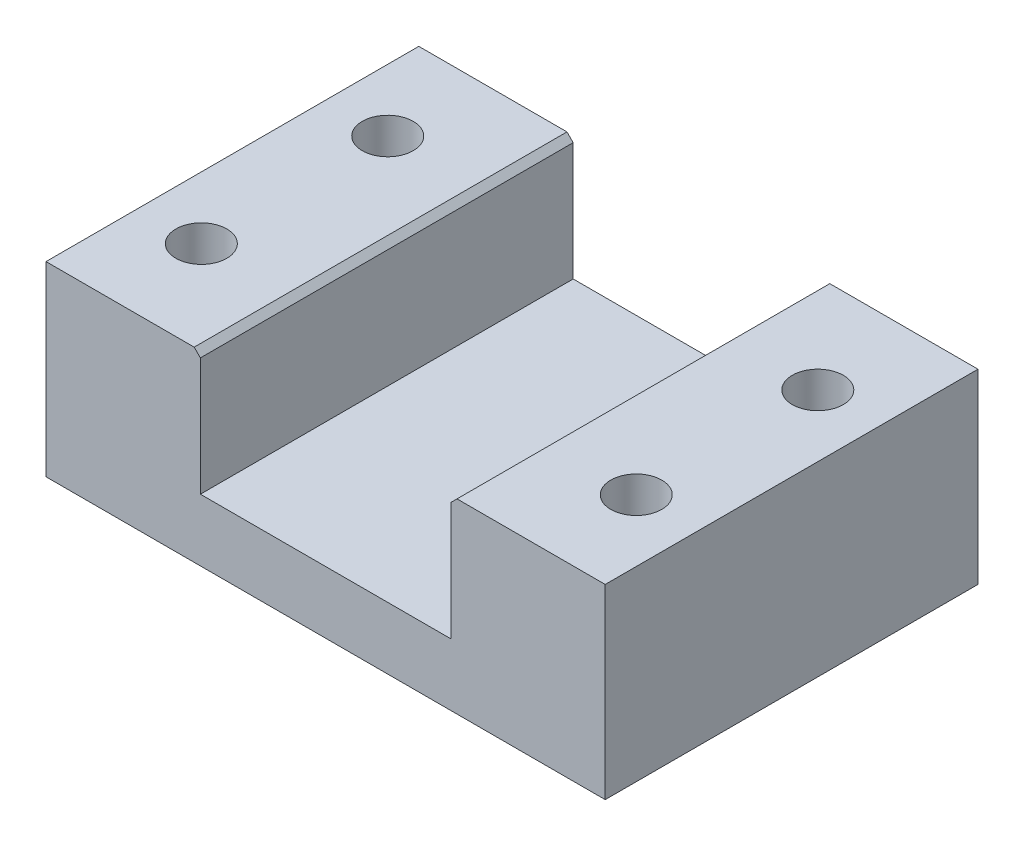
ISO-10303-21;
HEADER;
FILE_DESCRIPTION(('STEP AP214'),'2;1');
FILE_NAME('part.step','',(''),(''),'','','');
FILE_SCHEMA(('AUTOMOTIVE_DESIGN { 1 0 10303 214 1 1 1 1 }'));
ENDSEC;
DATA;
#1=APPLICATION_CONTEXT('core data for automotive mechanical design processes');
#2=APPLICATION_PROTOCOL_DEFINITION('international standard','automotive_design',2000,#1);
#3=PRODUCT_CONTEXT('',#1,'mechanical');
#4=PRODUCT('Part','Part','',(#3));
#5=PRODUCT_RELATED_PRODUCT_CATEGORY('part','',(#4));
#6=PRODUCT_DEFINITION_FORMATION('','',#4);
#7=PRODUCT_DEFINITION_CONTEXT('part definition',#1,'design');
#8=PRODUCT_DEFINITION('design','',#6,#7);
#9=PRODUCT_DEFINITION_SHAPE('','',#8);
#10=(LENGTH_UNIT() NAMED_UNIT(*) SI_UNIT(.MILLI.,.METRE.));
#11=(NAMED_UNIT(*) PLANE_ANGLE_UNIT() SI_UNIT($,.RADIAN.));
#12=(NAMED_UNIT(*) SI_UNIT($,.STERADIAN.) SOLID_ANGLE_UNIT());
#13=UNCERTAINTY_MEASURE_WITH_UNIT(LENGTH_MEASURE(1.E-05),#10,'distance_accuracy_value','');
#14=(GEOMETRIC_REPRESENTATION_CONTEXT(3) GLOBAL_UNCERTAINTY_ASSIGNED_CONTEXT((#13)) GLOBAL_UNIT_ASSIGNED_CONTEXT((#10,
#11,#12)) REPRESENTATION_CONTEXT('',''));
#15=CARTESIAN_POINT('',(0.,0.,0.));
#16=DIRECTION('',(0.,0.,1.));
#17=DIRECTION('',(1.,0.,0.));
#18=AXIS2_PLACEMENT_3D('',#15,#16,#17);
#19=CARTESIAN_POINT('',(-35.,30.,15.));
#20=DIRECTION('',(0.,-1.,0.));
#21=DIRECTION('',(0.,0.,-1.));
#22=AXIS2_PLACEMENT_3D('',#19,#20,#21);
#23=CYLINDRICAL_SURFACE('',#22,4.1);
#24=CARTESIAN_POINT('',(-35.,30.,15.));
#25=DIRECTION('',(0.,-1.,0.));
#26=DIRECTION('',(0.,0.,-1.));
#27=AXIS2_PLACEMENT_3D('',#24,#25,#26);
#28=CIRCLE('',#27,4.1);
#29=CARTESIAN_POINT('',(-35.,30.,10.9));
#30=VERTEX_POINT('',#29);
#31=EDGE_CURVE('E143',#30,#30,#28,.T.);
#32=ORIENTED_EDGE('',*,*,#31,.F.);
#33=EDGE_LOOP('',(#32));
#34=FACE_BOUND('',#33,.T.);
#35=CARTESIAN_POINT('',(-35.,10.,15.));
#36=DIRECTION('',(0.,-1.,0.));
#37=DIRECTION('',(0.,0.,-1.));
#38=AXIS2_PLACEMENT_3D('',#35,#36,#37);
#39=CIRCLE('',#38,4.1);
#40=CARTESIAN_POINT('',(-35.,10.,10.9));
#41=VERTEX_POINT('',#40);
#42=EDGE_CURVE('E194',#41,#41,#39,.F.);
#43=ORIENTED_EDGE('',*,*,#42,.F.);
#44=EDGE_LOOP('',(#43));
#45=FACE_BOUND('',#44,.T.);
#46=ADVANCED_FACE('F35',(#34,#45),#23,.F.);
#47=CARTESIAN_POINT('',(35.,30.,-14.2172732356869));
#48=DIRECTION('',(0.,-1.,0.));
#49=DIRECTION('',(0.,0.,-1.));
#50=AXIS2_PLACEMENT_3D('',#47,#48,#49);
#51=CYLINDRICAL_SURFACE('',#50,4.1);
#52=CARTESIAN_POINT('',(35.,30.,-14.2172732356869));
#53=DIRECTION('',(0.,-1.,0.));
#54=DIRECTION('',(0.,0.,-1.));
#55=AXIS2_PLACEMENT_3D('',#52,#53,#54);
#56=CIRCLE('',#55,4.1);
#57=CARTESIAN_POINT('',(35.,30.,-18.3172732356869));
#58=VERTEX_POINT('',#57);
#59=EDGE_CURVE('E328',#58,#58,#56,.T.);
#60=ORIENTED_EDGE('',*,*,#59,.F.);
#61=EDGE_LOOP('',(#60));
#62=FACE_BOUND('',#61,.T.);
#63=CARTESIAN_POINT('',(35.,10.,-14.2172732356869));
#64=DIRECTION('',(0.,-1.,0.));
#65=DIRECTION('',(0.,0.,-1.));
#66=AXIS2_PLACEMENT_3D('',#63,#64,#65);
#67=CIRCLE('',#66,4.1);
#68=CARTESIAN_POINT('',(35.,10.,-18.3172732356869));
#69=VERTEX_POINT('',#68);
#70=EDGE_CURVE('E190',#69,#69,#67,.F.);
#71=ORIENTED_EDGE('',*,*,#70,.F.);
#72=EDGE_LOOP('',(#71));
#73=FACE_BOUND('',#72,.T.);
#74=ADVANCED_FACE('F253',(#62,#73),#51,.F.);
#75=CARTESIAN_POINT('',(-35.,30.,-15.));
#76=DIRECTION('',(0.,-1.,0.));
#77=DIRECTION('',(0.,0.,-1.));
#78=AXIS2_PLACEMENT_3D('',#75,#76,#77);
#79=CYLINDRICAL_SURFACE('',#78,4.1);
#80=CARTESIAN_POINT('',(-35.,30.,-15.));
#81=DIRECTION('',(0.,-1.,0.));
#82=DIRECTION('',(0.,0.,-1.));
#83=AXIS2_PLACEMENT_3D('',#80,#81,#82);
#84=CIRCLE('',#83,4.1);
#85=CARTESIAN_POINT('',(-35.,30.,-19.1));
#86=VERTEX_POINT('',#85);
#87=EDGE_CURVE('E325',#86,#86,#84,.T.);
#88=ORIENTED_EDGE('',*,*,#87,.F.);
#89=EDGE_LOOP('',(#88));
#90=FACE_BOUND('',#89,.T.);
#91=CARTESIAN_POINT('',(-35.,10.,-15.));
#92=DIRECTION('',(0.,-1.,0.));
#93=DIRECTION('',(0.,0.,-1.));
#94=AXIS2_PLACEMENT_3D('',#91,#92,#93);
#95=CIRCLE('',#94,4.1);
#96=CARTESIAN_POINT('',(-35.,10.,-19.1));
#97=VERTEX_POINT('',#96);
#98=EDGE_CURVE('E187',#97,#97,#95,.F.);
#99=ORIENTED_EDGE('',*,*,#98,.F.);
#100=EDGE_LOOP('',(#99));
#101=FACE_BOUND('',#100,.T.);
#102=ADVANCED_FACE('F243',(#90,#101),#79,.F.);
#103=CARTESIAN_POINT('',(35.,30.,15.));
#104=DIRECTION('',(0.,-1.,0.));
#105=DIRECTION('',(0.,0.,-1.));
#106=AXIS2_PLACEMENT_3D('',#103,#104,#105);
#107=CYLINDRICAL_SURFACE('',#106,4.1);
#108=CARTESIAN_POINT('',(35.,30.,15.));
#109=DIRECTION('',(0.,-1.,0.));
#110=DIRECTION('',(0.,0.,-1.));
#111=AXIS2_PLACEMENT_3D('',#108,#109,#110);
#112=CIRCLE('',#111,4.1);
#113=CARTESIAN_POINT('',(35.,30.,10.9));
#114=VERTEX_POINT('',#113);
#115=EDGE_CURVE('E185',#114,#114,#112,.T.);
#116=ORIENTED_EDGE('',*,*,#115,.F.);
#117=EDGE_LOOP('',(#116));
#118=FACE_BOUND('',#117,.T.);
#119=CARTESIAN_POINT('',(35.,10.,15.));
#120=DIRECTION('',(0.,-1.,0.));
#121=DIRECTION('',(0.,0.,-1.));
#122=AXIS2_PLACEMENT_3D('',#119,#120,#121);
#123=CIRCLE('',#122,4.1);
#124=CARTESIAN_POINT('',(35.,10.,10.9));
#125=VERTEX_POINT('',#124);
#126=EDGE_CURVE('E182',#125,#125,#123,.F.);
#127=ORIENTED_EDGE('',*,*,#126,.F.);
#128=EDGE_LOOP('',(#127));
#129=FACE_BOUND('',#128,.T.);
#130=ADVANCED_FACE('F235',(#118,#129),#107,.F.);
#131=CARTESIAN_POINT('',(0.,30.,0.));
#132=DIRECTION('',(0.,1.,0.));
#133=DIRECTION('',(0.,0.,1.));
#134=AXIS2_PLACEMENT_3D('',#131,#132,#133);
#135=PLANE('',#134);
#136=ORIENTED_EDGE('',*,*,#87,.T.);
#137=EDGE_LOOP('',(#136));
#138=FACE_BOUND('',#137,.T.);
#139=ORIENTED_EDGE('',*,*,#31,.T.);
#140=EDGE_LOOP('',(#139));
#141=FACE_BOUND('',#140,.T.);
#142=DIRECTION('',(1.,0.,0.));
#143=VECTOR('',#142,1.);
#144=CARTESIAN_POINT('',(45.,30.,30.));
#145=LINE('',#144,#143);
#146=CARTESIAN_POINT('',(-45.,30.,30.));
#147=VERTEX_POINT('',#146);
#148=CARTESIAN_POINT('',(-21.15,30.,30.));
#149=VERTEX_POINT('',#148);
#150=EDGE_CURVE('E154',#147,#149,#145,.T.);
#151=ORIENTED_EDGE('',*,*,#150,.T.);
#152=DIRECTION('',(0.,0.,-1.));
#153=VECTOR('',#152,1.);
#154=CARTESIAN_POINT('',(-21.15,30.,-30.));
#155=LINE('',#154,#153);
#156=CARTESIAN_POINT('',(-21.15,30.,-30.));
#157=VERTEX_POINT('',#156);
#158=EDGE_CURVE('E203',#149,#157,#155,.T.);
#159=ORIENTED_EDGE('',*,*,#158,.T.);
#160=DIRECTION('',(-1.,0.,0.));
#161=VECTOR('',#160,1.);
#162=CARTESIAN_POINT('',(45.,30.,-30.));
#163=LINE('',#162,#161);
#164=CARTESIAN_POINT('',(-45.,30.,-30.));
#165=VERTEX_POINT('',#164);
#166=EDGE_CURVE('E159',#157,#165,#163,.T.);
#167=ORIENTED_EDGE('',*,*,#166,.T.);
#168=DIRECTION('',(0.,0.,1.));
#169=VECTOR('',#168,1.);
#170=CARTESIAN_POINT('',(-45.,30.,30.));
#171=LINE('',#170,#169);
#172=EDGE_CURVE('E149',#165,#147,#171,.T.);
#173=ORIENTED_EDGE('',*,*,#172,.T.);
#174=EDGE_LOOP('',(#151,#159,#167,#173));
#175=FACE_BOUND('',#174,.T.);
#176=ADVANCED_FACE('F233',(#138,#141,#175),#135,.T.);
#177=CARTESIAN_POINT('',(-45.,30.,30.));
#178=DIRECTION('',(1.,0.,0.));
#179=DIRECTION('',(0.,0.,-1.));
#180=AXIS2_PLACEMENT_3D('',#177,#178,#179);
#181=PLANE('',#180);
#182=DIRECTION('',(0.,0.,1.));
#183=VECTOR('',#182,1.);
#184=CARTESIAN_POINT('',(-45.,0.,30.));
#185=LINE('',#184,#183);
#186=CARTESIAN_POINT('',(-45.,0.,-30.));
#187=VERTEX_POINT('',#186);
#188=CARTESIAN_POINT('',(-45.,0.,30.));
#189=VERTEX_POINT('',#188);
#190=EDGE_CURVE('E147',#187,#189,#185,.T.);
#191=ORIENTED_EDGE('',*,*,#190,.T.);
#192=DIRECTION('',(0.,-1.,0.));
#193=VECTOR('',#192,1.);
#194=CARTESIAN_POINT('',(-45.,30.,30.));
#195=LINE('',#194,#193);
#196=EDGE_CURVE('E178',#147,#189,#195,.T.);
#197=ORIENTED_EDGE('',*,*,#196,.F.);
#198=ORIENTED_EDGE('',*,*,#172,.F.);
#199=DIRECTION('',(0.,-1.,0.));
#200=VECTOR('',#199,1.);
#201=CARTESIAN_POINT('',(-45.,30.,-30.));
#202=LINE('',#201,#200);
#203=EDGE_CURVE('E162',#165,#187,#202,.T.);
#204=ORIENTED_EDGE('',*,*,#203,.T.);
#205=EDGE_LOOP('',(#191,#197,#198,#204));
#206=FACE_BOUND('',#205,.T.);
#207=ADVANCED_FACE('F227',(#206),#181,.F.);
#208=CARTESIAN_POINT('',(45.,30.,30.));
#209=DIRECTION('',(0.,0.,-1.));
#210=DIRECTION('',(-1.,0.,0.));
#211=AXIS2_PLACEMENT_3D('',#208,#209,#210);
#212=PLANE('',#211);
#213=DIRECTION('',(0.,-1.,0.));
#214=VECTOR('',#213,1.);
#215=CARTESIAN_POINT('',(-20.15,50.,30.));
#216=LINE('',#215,#214);
#217=CARTESIAN_POINT('',(-20.15,29.,30.));
#218=VERTEX_POINT('',#217);
#219=CARTESIAN_POINT('',(-20.15,10.,30.));
#220=VERTEX_POINT('',#219);
#221=EDGE_CURVE('E128',#218,#220,#216,.T.);
#222=ORIENTED_EDGE('',*,*,#221,.F.);
#223=DIRECTION('',(-0.707106781186549,0.707106781186546,0.));
#224=VECTOR('',#223,1.);
#225=CARTESIAN_POINT('',(-20.15,29.,30.));
#226=LINE('',#225,#224);
#227=EDGE_CURVE('E201',#218,#149,#226,.T.);
#228=ORIENTED_EDGE('',*,*,#227,.T.);
#229=ORIENTED_EDGE('',*,*,#150,.F.);
#230=ORIENTED_EDGE('',*,*,#196,.T.);
#231=DIRECTION('',(1.,0.,0.));
#232=VECTOR('',#231,1.);
#233=CARTESIAN_POINT('',(45.,0.,30.));
#234=LINE('',#233,#232);
#235=CARTESIAN_POINT('',(45.,0.,30.));
#236=VERTEX_POINT('',#235);
#237=EDGE_CURVE('E165',#189,#236,#234,.T.);
#238=ORIENTED_EDGE('',*,*,#237,.T.);
#239=DIRECTION('',(0.,-1.,0.));
#240=VECTOR('',#239,1.);
#241=CARTESIAN_POINT('',(45.,30.,30.));
#242=LINE('',#241,#240);
#243=CARTESIAN_POINT('',(45.,30.,30.));
#244=VERTEX_POINT('',#243);
#245=EDGE_CURVE('E175',#244,#236,#242,.T.);
#246=ORIENTED_EDGE('',*,*,#245,.F.);
#247=CARTESIAN_POINT('',(21.15,30.,30.));
#248=VERTEX_POINT('',#247);
#249=EDGE_CURVE('E152',#248,#244,#145,.T.);
#250=ORIENTED_EDGE('',*,*,#249,.F.);
#251=DIRECTION('',(-0.707106781186547,-0.707106781186547,0.));
#252=VECTOR('',#251,1.);
#253=CARTESIAN_POINT('',(20.15,29.,30.));
#254=LINE('',#253,#252);
#255=CARTESIAN_POINT('',(20.15,29.,30.));
#256=VERTEX_POINT('',#255);
#257=EDGE_CURVE('E199',#248,#256,#254,.T.);
#258=ORIENTED_EDGE('',*,*,#257,.T.);
#259=DIRECTION('',(0.,1.,0.));
#260=VECTOR('',#259,1.);
#261=CARTESIAN_POINT('',(20.15,50.,30.));
#262=LINE('',#261,#260);
#263=CARTESIAN_POINT('',(20.15,10.,30.));
#264=VERTEX_POINT('',#263);
#265=EDGE_CURVE('E122',#264,#256,#262,.T.);
#266=ORIENTED_EDGE('',*,*,#265,.F.);
#267=DIRECTION('',(1.,0.,0.));
#268=VECTOR('',#267,1.);
#269=CARTESIAN_POINT('',(20.15,10.,30.));
#270=LINE('',#269,#268);
#271=EDGE_CURVE('E142',#220,#264,#270,.T.);
#272=ORIENTED_EDGE('',*,*,#271,.F.);
#273=EDGE_LOOP('',(#222,#228,#229,#230,#238,#246,#250,#258,#266,#272));
#274=FACE_BOUND('',#273,.T.);
#275=ADVANCED_FACE('F212',(#274),#212,.F.);
#276=CARTESIAN_POINT('',(45.,30.,30.));
#277=DIRECTION('',(-1.,0.,0.));
#278=DIRECTION('',(0.,0.,1.));
#279=AXIS2_PLACEMENT_3D('',#276,#277,#278);
#280=PLANE('',#279);
#281=DIRECTION('',(0.,0.,-1.));
#282=VECTOR('',#281,1.);
#283=CARTESIAN_POINT('',(45.,0.,30.));
#284=LINE('',#283,#282);
#285=CARTESIAN_POINT('',(45.,0.,-30.));
#286=VERTEX_POINT('',#285);
#287=EDGE_CURVE('E167',#236,#286,#284,.T.);
#288=ORIENTED_EDGE('',*,*,#287,.T.);
#289=DIRECTION('',(0.,-1.,0.));
#290=VECTOR('',#289,1.);
#291=CARTESIAN_POINT('',(45.,30.,-30.));
#292=LINE('',#291,#290);
#293=CARTESIAN_POINT('',(45.,30.,-30.));
#294=VERTEX_POINT('',#293);
#295=EDGE_CURVE('E172',#294,#286,#292,.T.);
#296=ORIENTED_EDGE('',*,*,#295,.F.);
#297=DIRECTION('',(0.,0.,-1.));
#298=VECTOR('',#297,1.);
#299=CARTESIAN_POINT('',(45.,30.,30.));
#300=LINE('',#299,#298);
#301=EDGE_CURVE('E157',#244,#294,#300,.T.);
#302=ORIENTED_EDGE('',*,*,#301,.F.);
#303=ORIENTED_EDGE('',*,*,#245,.T.);
#304=EDGE_LOOP('',(#288,#296,#302,#303));
#305=FACE_BOUND('',#304,.T.);
#306=ADVANCED_FACE('F280',(#305),#280,.F.);
#307=CARTESIAN_POINT('',(45.,30.,-30.));
#308=DIRECTION('',(0.,0.,1.));
#309=DIRECTION('',(1.,0.,0.));
#310=AXIS2_PLACEMENT_3D('',#307,#308,#309);
#311=PLANE('',#310);
#312=ORIENTED_EDGE('',*,*,#166,.F.);
#313=DIRECTION('',(0.707106781186549,-0.707106781186546,0.));
#314=VECTOR('',#313,1.);
#315=CARTESIAN_POINT('',(-20.15,29.,-30.));
#316=LINE('',#315,#314);
#317=CARTESIAN_POINT('',(-20.15,29.,-30.));
#318=VERTEX_POINT('',#317);
#319=EDGE_CURVE('E118',#157,#318,#316,.T.);
#320=ORIENTED_EDGE('',*,*,#319,.T.);
#321=DIRECTION('',(0.,-1.,0.));
#322=VECTOR('',#321,1.);
#323=CARTESIAN_POINT('',(-20.15,50.,-30.));
#324=LINE('',#323,#322);
#325=CARTESIAN_POINT('',(-20.15,10.,-30.));
#326=VERTEX_POINT('',#325);
#327=EDGE_CURVE('E111',#318,#326,#324,.T.);
#328=ORIENTED_EDGE('',*,*,#327,.T.);
#329=DIRECTION('',(1.,0.,0.));
#330=VECTOR('',#329,1.);
#331=CARTESIAN_POINT('',(20.15,10.,-30.));
#332=LINE('',#331,#330);
#333=CARTESIAN_POINT('',(20.15,10.,-30.));
#334=VERTEX_POINT('',#333);
#335=EDGE_CURVE('E116',#326,#334,#332,.T.);
#336=ORIENTED_EDGE('',*,*,#335,.T.);
#337=DIRECTION('',(0.,1.,0.));
#338=VECTOR('',#337,1.);
#339=CARTESIAN_POINT('',(20.15,50.,-30.));
#340=LINE('',#339,#338);
#341=CARTESIAN_POINT('',(20.15,29.,-30.));
#342=VERTEX_POINT('',#341);
#343=EDGE_CURVE('E133',#334,#342,#340,.T.);
#344=ORIENTED_EDGE('',*,*,#343,.T.);
#345=DIRECTION('',(0.707106781186547,0.707106781186547,0.));
#346=VECTOR('',#345,1.);
#347=CARTESIAN_POINT('',(20.15,29.,-30.));
#348=LINE('',#347,#346);
#349=CARTESIAN_POINT('',(21.15,30.,-30.));
#350=VERTEX_POINT('',#349);
#351=EDGE_CURVE('E50',#342,#350,#348,.T.);
#352=ORIENTED_EDGE('',*,*,#351,.T.);
#353=EDGE_CURVE('E160',#294,#350,#163,.T.);
#354=ORIENTED_EDGE('',*,*,#353,.F.);
#355=ORIENTED_EDGE('',*,*,#295,.T.);
#356=DIRECTION('',(-1.,0.,0.));
#357=VECTOR('',#356,1.);
#358=CARTESIAN_POINT('',(45.,0.,-30.));
#359=LINE('',#358,#357);
#360=EDGE_CURVE('E153',#286,#187,#359,.T.);
#361=ORIENTED_EDGE('',*,*,#360,.T.);
#362=ORIENTED_EDGE('',*,*,#203,.F.);
#363=EDGE_LOOP('',(#312,#320,#328,#336,#344,#352,#354,#355,#361,#362));
#364=FACE_BOUND('',#363,.T.);
#365=ADVANCED_FACE('F114',(#364),#311,.F.);
#366=ORIENTED_EDGE('',*,*,#59,.T.);
#367=EDGE_LOOP('',(#366));
#368=FACE_BOUND('',#367,.T.);
#369=ORIENTED_EDGE('',*,*,#115,.T.);
#370=EDGE_LOOP('',(#369));
#371=FACE_BOUND('',#370,.T.);
#372=ORIENTED_EDGE('',*,*,#353,.T.);
#373=DIRECTION('',(0.,0.,1.));
#374=VECTOR('',#373,1.);
#375=CARTESIAN_POINT('',(21.15,30.,30.));
#376=LINE('',#375,#374);
#377=EDGE_CURVE('E11',#350,#248,#376,.T.);
#378=ORIENTED_EDGE('',*,*,#377,.T.);
#379=ORIENTED_EDGE('',*,*,#249,.T.);
#380=ORIENTED_EDGE('',*,*,#301,.T.);
#381=EDGE_LOOP('',(#372,#378,#379,#380));
#382=FACE_BOUND('',#381,.T.);
#383=ADVANCED_FACE('F216',(#368,#371,#382),#135,.T.);
#384=CARTESIAN_POINT('',(0.,0.,0.));
#385=DIRECTION('',(0.,1.,0.));
#386=DIRECTION('',(0.,0.,1.));
#387=AXIS2_PLACEMENT_3D('',#384,#385,#386);
#388=PLANE('',#387);
#389=CARTESIAN_POINT('',(35.,0.,-14.2172732356869));
#390=DIRECTION('',(0.,-1.,0.));
#391=DIRECTION('',(0.,0.,-1.));
#392=AXIS2_PLACEMENT_3D('',#389,#390,#391);
#393=CIRCLE('',#392,8.8);
#394=CARTESIAN_POINT('',(35.,0.,-23.0172732356869));
#395=VERTEX_POINT('',#394);
#396=EDGE_CURVE('E357',#395,#395,#393,.T.);
#397=ORIENTED_EDGE('',*,*,#396,.F.);
#398=EDGE_LOOP('',(#397));
#399=FACE_BOUND('',#398,.T.);
#400=CARTESIAN_POINT('',(-35.,0.,15.));
#401=DIRECTION('',(0.,-1.,0.));
#402=DIRECTION('',(0.,0.,-1.));
#403=AXIS2_PLACEMENT_3D('',#400,#401,#402);
#404=CIRCLE('',#403,8.8);
#405=CARTESIAN_POINT('',(-35.,0.,6.2));
#406=VERTEX_POINT('',#405);
#407=EDGE_CURVE('E351',#406,#406,#404,.T.);
#408=ORIENTED_EDGE('',*,*,#407,.F.);
#409=EDGE_LOOP('',(#408));
#410=FACE_BOUND('',#409,.T.);
#411=CARTESIAN_POINT('',(-35.,0.,-15.));
#412=DIRECTION('',(0.,-1.,0.));
#413=DIRECTION('',(0.,0.,-1.));
#414=AXIS2_PLACEMENT_3D('',#411,#412,#413);
#415=CIRCLE('',#414,8.8);
#416=CARTESIAN_POINT('',(-35.,0.,-23.8));
#417=VERTEX_POINT('',#416);
#418=EDGE_CURVE('E345',#417,#417,#415,.T.);
#419=ORIENTED_EDGE('',*,*,#418,.F.);
#420=EDGE_LOOP('',(#419));
#421=FACE_BOUND('',#420,.T.);
#422=CARTESIAN_POINT('',(35.,0.,15.));
#423=DIRECTION('',(0.,-1.,0.));
#424=DIRECTION('',(0.,0.,-1.));
#425=AXIS2_PLACEMENT_3D('',#422,#423,#424);
#426=CIRCLE('',#425,8.8);
#427=CARTESIAN_POINT('',(35.,0.,6.2));
#428=VERTEX_POINT('',#427);
#429=EDGE_CURVE('E197',#428,#428,#426,.T.);
#430=ORIENTED_EDGE('',*,*,#429,.F.);
#431=EDGE_LOOP('',(#430));
#432=FACE_BOUND('',#431,.T.);
#433=ORIENTED_EDGE('',*,*,#190,.F.);
#434=ORIENTED_EDGE('',*,*,#360,.F.);
#435=ORIENTED_EDGE('',*,*,#287,.F.);
#436=ORIENTED_EDGE('',*,*,#237,.F.);
#437=EDGE_LOOP('',(#433,#434,#435,#436));
#438=FACE_BOUND('',#437,.T.);
#439=ADVANCED_FACE('F224',(#399,#410,#421,#432,#438),#388,.F.);
#440=CARTESIAN_POINT('',(-20.15,50.,-30.));
#441=DIRECTION('',(-1.,0.,0.));
#442=DIRECTION('',(0.,-1.,0.));
#443=AXIS2_PLACEMENT_3D('',#440,#441,#442);
#444=PLANE('',#443);
#445=ORIENTED_EDGE('',*,*,#327,.F.);
#446=DIRECTION('',(0.,0.,1.));
#447=VECTOR('',#446,1.);
#448=CARTESIAN_POINT('',(-20.15,29.,30.));
#449=LINE('',#448,#447);
#450=EDGE_CURVE('E181',#318,#218,#449,.T.);
#451=ORIENTED_EDGE('',*,*,#450,.T.);
#452=ORIENTED_EDGE('',*,*,#221,.T.);
#453=DIRECTION('',(0.,0.,1.));
#454=VECTOR('',#453,1.);
#455=CARTESIAN_POINT('',(-20.15,10.,-30.));
#456=LINE('',#455,#454);
#457=EDGE_CURVE('E125',#326,#220,#456,.T.);
#458=ORIENTED_EDGE('',*,*,#457,.F.);
#459=EDGE_LOOP('',(#445,#451,#452,#458));
#460=FACE_BOUND('',#459,.T.);
#461=ADVANCED_FACE('F126',(#460),#444,.F.);
#462=CARTESIAN_POINT('',(20.15,50.,-30.));
#463=DIRECTION('',(1.,0.,0.));
#464=DIRECTION('',(0.,0.,-1.));
#465=AXIS2_PLACEMENT_3D('',#462,#463,#464);
#466=PLANE('',#465);
#467=ORIENTED_EDGE('',*,*,#265,.T.);
#468=DIRECTION('',(0.,0.,-1.));
#469=VECTOR('',#468,1.);
#470=CARTESIAN_POINT('',(20.15,29.,-30.));
#471=LINE('',#470,#469);
#472=EDGE_CURVE('E43',#256,#342,#471,.T.);
#473=ORIENTED_EDGE('',*,*,#472,.T.);
#474=ORIENTED_EDGE('',*,*,#343,.F.);
#475=DIRECTION('',(0.,0.,1.));
#476=VECTOR('',#475,1.);
#477=CARTESIAN_POINT('',(20.15,10.,-30.));
#478=LINE('',#477,#476);
#479=EDGE_CURVE('E132',#334,#264,#478,.T.);
#480=ORIENTED_EDGE('',*,*,#479,.T.);
#481=EDGE_LOOP('',(#467,#473,#474,#480));
#482=FACE_BOUND('',#481,.T.);
#483=ADVANCED_FACE('F207',(#482),#466,.F.);
#484=CARTESIAN_POINT('',(20.15,10.,-30.));
#485=DIRECTION('',(0.,-1.,0.));
#486=DIRECTION('',(1.,0.,0.));
#487=AXIS2_PLACEMENT_3D('',#484,#485,#486);
#488=PLANE('',#487);
#489=ORIENTED_EDGE('',*,*,#271,.T.);
#490=ORIENTED_EDGE('',*,*,#479,.F.);
#491=ORIENTED_EDGE('',*,*,#335,.F.);
#492=ORIENTED_EDGE('',*,*,#457,.T.);
#493=EDGE_LOOP('',(#489,#490,#491,#492));
#494=FACE_BOUND('',#493,.T.);
#495=ADVANCED_FACE('F135',(#494),#488,.F.);
#496=CARTESIAN_POINT('',(35.,10.,15.));
#497=DIRECTION('',(0.,-1.,0.));
#498=DIRECTION('',(0.,0.,-1.));
#499=AXIS2_PLACEMENT_3D('',#496,#497,#498);
#500=PLANE('',#499);
#501=CARTESIAN_POINT('',(35.,10.,15.));
#502=DIRECTION('',(0.,-1.,0.));
#503=DIRECTION('',(0.,0.,-1.));
#504=AXIS2_PLACEMENT_3D('',#501,#502,#503);
#505=CIRCLE('',#504,8.8);
#506=CARTESIAN_POINT('',(35.,10.,6.2));
#507=VERTEX_POINT('',#506);
#508=EDGE_CURVE('E186',#507,#507,#505,.T.);
#509=ORIENTED_EDGE('',*,*,#508,.T.);
#510=EDGE_LOOP('',(#509));
#511=FACE_BOUND('',#510,.T.);
#512=ORIENTED_EDGE('',*,*,#126,.T.);
#513=EDGE_LOOP('',(#512));
#514=FACE_BOUND('',#513,.T.);
#515=ADVANCED_FACE('F267',(#511,#514),#500,.T.);
#516=CARTESIAN_POINT('',(35.,10.,15.));
#517=DIRECTION('',(0.,-1.,0.));
#518=DIRECTION('',(0.,0.,-1.));
#519=AXIS2_PLACEMENT_3D('',#516,#517,#518);
#520=CYLINDRICAL_SURFACE('',#519,8.8);
#521=ORIENTED_EDGE('',*,*,#508,.F.);
#522=EDGE_LOOP('',(#521));
#523=FACE_BOUND('',#522,.T.);
#524=ORIENTED_EDGE('',*,*,#429,.T.);
#525=EDGE_LOOP('',(#524));
#526=FACE_BOUND('',#525,.T.);
#527=ADVANCED_FACE('F307',(#523,#526),#520,.F.);
#528=CARTESIAN_POINT('',(-35.,10.,-15.));
#529=DIRECTION('',(0.,-1.,0.));
#530=DIRECTION('',(0.,0.,-1.));
#531=AXIS2_PLACEMENT_3D('',#528,#529,#530);
#532=PLANE('',#531);
#533=CARTESIAN_POINT('',(-35.,10.,-15.));
#534=DIRECTION('',(0.,-1.,0.));
#535=DIRECTION('',(0.,0.,-1.));
#536=AXIS2_PLACEMENT_3D('',#533,#534,#535);
#537=CIRCLE('',#536,8.8);
#538=CARTESIAN_POINT('',(-35.,10.,-23.8));
#539=VERTEX_POINT('',#538);
#540=EDGE_CURVE('E348',#539,#539,#537,.T.);
#541=ORIENTED_EDGE('',*,*,#540,.T.);
#542=EDGE_LOOP('',(#541));
#543=FACE_BOUND('',#542,.T.);
#544=ORIENTED_EDGE('',*,*,#98,.T.);
#545=EDGE_LOOP('',(#544));
#546=FACE_BOUND('',#545,.T.);
#547=ADVANCED_FACE('F303',(#543,#546),#532,.T.);
#548=CARTESIAN_POINT('',(-35.,10.,-15.));
#549=DIRECTION('',(0.,-1.,0.));
#550=DIRECTION('',(0.,0.,-1.));
#551=AXIS2_PLACEMENT_3D('',#548,#549,#550);
#552=CYLINDRICAL_SURFACE('',#551,8.8);
#553=ORIENTED_EDGE('',*,*,#540,.F.);
#554=EDGE_LOOP('',(#553));
#555=FACE_BOUND('',#554,.T.);
#556=ORIENTED_EDGE('',*,*,#418,.T.);
#557=EDGE_LOOP('',(#556));
#558=FACE_BOUND('',#557,.T.);
#559=ADVANCED_FACE('F306',(#555,#558),#552,.F.);
#560=CARTESIAN_POINT('',(35.,10.,-14.2172732356869));
#561=DIRECTION('',(0.,-1.,0.));
#562=DIRECTION('',(0.,0.,-1.));
#563=AXIS2_PLACEMENT_3D('',#560,#561,#562);
#564=PLANE('',#563);
#565=CARTESIAN_POINT('',(35.,10.,-14.2172732356869));
#566=DIRECTION('',(0.,-1.,0.));
#567=DIRECTION('',(0.,0.,-1.));
#568=AXIS2_PLACEMENT_3D('',#565,#566,#567);
#569=CIRCLE('',#568,8.8);
#570=CARTESIAN_POINT('',(35.,10.,-23.0172732356869));
#571=VERTEX_POINT('',#570);
#572=EDGE_CURVE('E191',#571,#571,#569,.T.);
#573=ORIENTED_EDGE('',*,*,#572,.T.);
#574=EDGE_LOOP('',(#573));
#575=FACE_BOUND('',#574,.T.);
#576=ORIENTED_EDGE('',*,*,#70,.T.);
#577=EDGE_LOOP('',(#576));
#578=FACE_BOUND('',#577,.T.);
#579=ADVANCED_FACE('F311',(#575,#578),#564,.T.);
#580=CARTESIAN_POINT('',(35.,10.,-14.2172732356869));
#581=DIRECTION('',(0.,-1.,0.));
#582=DIRECTION('',(0.,0.,-1.));
#583=AXIS2_PLACEMENT_3D('',#580,#581,#582);
#584=CYLINDRICAL_SURFACE('',#583,8.8);
#585=ORIENTED_EDGE('',*,*,#572,.F.);
#586=EDGE_LOOP('',(#585));
#587=FACE_BOUND('',#586,.T.);
#588=ORIENTED_EDGE('',*,*,#396,.T.);
#589=EDGE_LOOP('',(#588));
#590=FACE_BOUND('',#589,.T.);
#591=ADVANCED_FACE('F296',(#587,#590),#584,.F.);
#592=CARTESIAN_POINT('',(-35.,10.,15.));
#593=DIRECTION('',(0.,-1.,0.));
#594=DIRECTION('',(0.,0.,-1.));
#595=AXIS2_PLACEMENT_3D('',#592,#593,#594);
#596=PLANE('',#595);
#597=CARTESIAN_POINT('',(-35.,10.,15.));
#598=DIRECTION('',(0.,-1.,0.));
#599=DIRECTION('',(0.,0.,-1.));
#600=AXIS2_PLACEMENT_3D('',#597,#598,#599);
#601=CIRCLE('',#600,8.8);
#602=CARTESIAN_POINT('',(-35.,10.,6.2));
#603=VERTEX_POINT('',#602);
#604=EDGE_CURVE('E354',#603,#603,#601,.T.);
#605=ORIENTED_EDGE('',*,*,#604,.T.);
#606=EDGE_LOOP('',(#605));
#607=FACE_BOUND('',#606,.T.);
#608=ORIENTED_EDGE('',*,*,#42,.T.);
#609=EDGE_LOOP('',(#608));
#610=FACE_BOUND('',#609,.T.);
#611=ADVANCED_FACE('F290',(#607,#610),#596,.T.);
#612=CARTESIAN_POINT('',(-35.,10.,15.));
#613=DIRECTION('',(0.,-1.,0.));
#614=DIRECTION('',(0.,0.,-1.));
#615=AXIS2_PLACEMENT_3D('',#612,#613,#614);
#616=CYLINDRICAL_SURFACE('',#615,8.8);
#617=ORIENTED_EDGE('',*,*,#604,.F.);
#618=EDGE_LOOP('',(#617));
#619=FACE_BOUND('',#618,.T.);
#620=ORIENTED_EDGE('',*,*,#407,.T.);
#621=EDGE_LOOP('',(#620));
#622=FACE_BOUND('',#621,.T.);
#623=ADVANCED_FACE('F285',(#619,#622),#616,.F.);
#624=CARTESIAN_POINT('',(-20.15,29.,-30.));
#625=DIRECTION('',(0.707106781186546,0.707106781186549,0.));
#626=DIRECTION('',(0.,0.,-1.));
#627=AXIS2_PLACEMENT_3D('',#624,#625,#626);
#628=PLANE('',#627);
#629=ORIENTED_EDGE('',*,*,#319,.F.);
#630=ORIENTED_EDGE('',*,*,#158,.F.);
#631=ORIENTED_EDGE('',*,*,#227,.F.);
#632=ORIENTED_EDGE('',*,*,#450,.F.);
#633=EDGE_LOOP('',(#629,#630,#631,#632));
#634=FACE_BOUND('',#633,.T.);
#635=ADVANCED_FACE('F232',(#634),#628,.T.);
#636=CARTESIAN_POINT('',(20.15,29.,-30.));
#637=DIRECTION('',(-0.707106781186547,0.707106781186547,0.));
#638=DIRECTION('',(0.,0.,1.));
#639=AXIS2_PLACEMENT_3D('',#636,#637,#638);
#640=PLANE('',#639);
#641=ORIENTED_EDGE('',*,*,#257,.F.);
#642=ORIENTED_EDGE('',*,*,#377,.F.);
#643=ORIENTED_EDGE('',*,*,#351,.F.);
#644=ORIENTED_EDGE('',*,*,#472,.F.);
#645=EDGE_LOOP('',(#641,#642,#643,#644));
#646=FACE_BOUND('',#645,.T.);
#647=ADVANCED_FACE('F37',(#646),#640,.T.);
#648=CLOSED_SHELL('',(#46,#74,#102,#130,#176,#207,#275,#306,#365,#383,#439,#461,#483,#495,#515,
#527,#547,#559,#579,#591,#611,#623,#635,#647));
#649=MANIFOLD_SOLID_BREP('B2',#648);
#650=ADVANCED_BREP_SHAPE_REPRESENTATION('',(#18,#649),#14);
#651=SHAPE_DEFINITION_REPRESENTATION(#9,#650);
ENDSEC;
END-ISO-10303-21;
